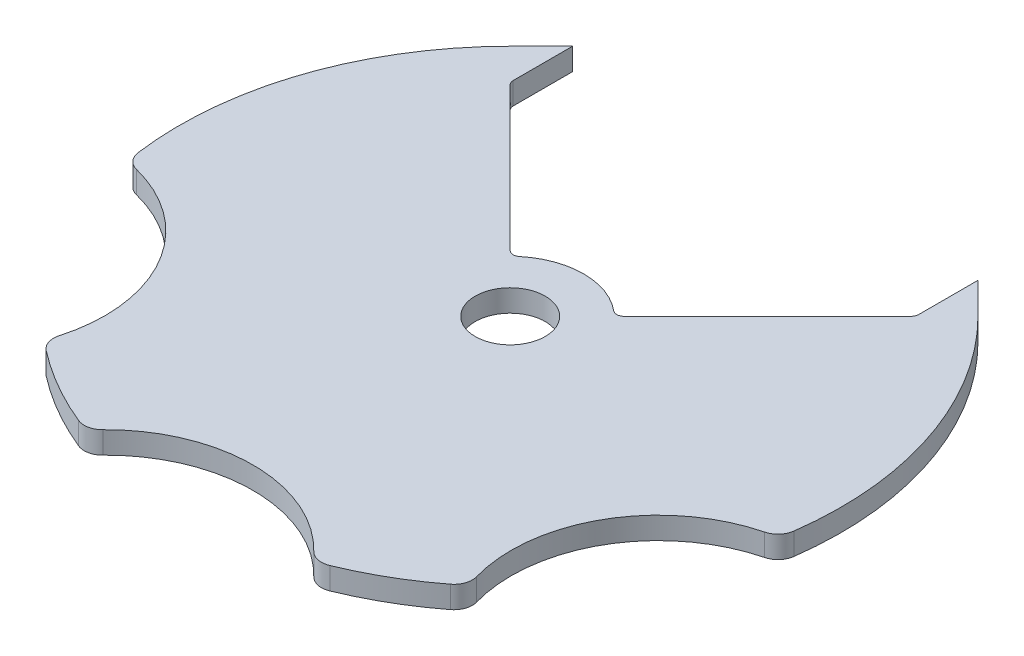
ISO-10303-21;
HEADER;
FILE_DESCRIPTION(('STEP AP214'),'2;1');
FILE_NAME('part.step','',(''),(''),'','','');
FILE_SCHEMA(('AUTOMOTIVE_DESIGN { 1 0 10303 214 1 1 1 1 }'));
ENDSEC;
DATA;
#1=APPLICATION_CONTEXT('core data for automotive mechanical design processes');
#2=APPLICATION_PROTOCOL_DEFINITION('international standard','automotive_design',2000,#1);
#3=PRODUCT_CONTEXT('',#1,'mechanical');
#4=PRODUCT('Part','Part','',(#3));
#5=PRODUCT_RELATED_PRODUCT_CATEGORY('part','',(#4));
#6=PRODUCT_DEFINITION_FORMATION('','',#4);
#7=PRODUCT_DEFINITION_CONTEXT('part definition',#1,'design');
#8=PRODUCT_DEFINITION('design','',#6,#7);
#9=PRODUCT_DEFINITION_SHAPE('','',#8);
#10=(LENGTH_UNIT() NAMED_UNIT(*) SI_UNIT(.MILLI.,.METRE.));
#11=(NAMED_UNIT(*) PLANE_ANGLE_UNIT() SI_UNIT($,.RADIAN.));
#12=(NAMED_UNIT(*) SI_UNIT($,.STERADIAN.) SOLID_ANGLE_UNIT());
#13=UNCERTAINTY_MEASURE_WITH_UNIT(LENGTH_MEASURE(1.E-05),#10,'distance_accuracy_value','');
#14=(GEOMETRIC_REPRESENTATION_CONTEXT(3) GLOBAL_UNCERTAINTY_ASSIGNED_CONTEXT((#13)) GLOBAL_UNIT_ASSIGNED_CONTEXT((#10,
#11,#12)) REPRESENTATION_CONTEXT('',''));
#15=CARTESIAN_POINT('',(0.,0.,0.));
#16=DIRECTION('',(0.,0.,1.));
#17=DIRECTION('',(1.,0.,0.));
#18=AXIS2_PLACEMENT_3D('',#15,#16,#17);
#19=CARTESIAN_POINT('',(0.,3.,0.));
#20=DIRECTION('',(0.,-1.,0.));
#21=DIRECTION('',(0.,0.,-1.));
#22=AXIS2_PLACEMENT_3D('',#19,#20,#21);
#23=CYLINDRICAL_SURFACE('',#22,45.);
#24=CARTESIAN_POINT('',(0.,0.,0.));
#25=DIRECTION('',(0.,1.,0.));
#26=DIRECTION('',(0.,0.,1.));
#27=AXIS2_PLACEMENT_3D('',#24,#25,#26);
#28=CIRCLE('',#27,45.);
#29=CARTESIAN_POINT('',(-31.8198051533945,0.,-31.8198051533948));
#30=VERTEX_POINT('',#29);
#31=CARTESIAN_POINT('',(-44.5954508550735,0.,6.02044541813344));
#32=VERTEX_POINT('',#31);
#33=EDGE_CURVE('E282',#30,#32,#28,.T.);
#34=ORIENTED_EDGE('',*,*,#33,.T.);
#35=DIRECTION('',(0.,-1.,0.));
#36=VECTOR('',#35,1.);
#37=CARTESIAN_POINT('',(-44.5954508550735,3.,6.02044541813344));
#38=LINE('',#37,#36);
#39=CARTESIAN_POINT('',(-44.5954508550735,3.,6.02044541813344));
#40=VERTEX_POINT('',#39);
#41=EDGE_CURVE('E13',#32,#40,#38,.F.);
#42=ORIENTED_EDGE('',*,*,#41,.T.);
#43=CARTESIAN_POINT('',(0.,3.,0.));
#44=DIRECTION('',(0.,1.,0.));
#45=DIRECTION('',(0.,0.,1.));
#46=AXIS2_PLACEMENT_3D('',#43,#44,#45);
#47=CIRCLE('',#46,45.);
#48=CARTESIAN_POINT('',(-31.8198051533945,3.,-31.8198051533948));
#49=VERTEX_POINT('',#48);
#50=EDGE_CURVE('E267',#49,#40,#47,.T.);
#51=ORIENTED_EDGE('',*,*,#50,.F.);
#52=DIRECTION('',(0.,-1.,0.));
#53=VECTOR('',#52,1.);
#54=CARTESIAN_POINT('',(-31.8198051533945,3.,-31.8198051533948));
#55=LINE('',#54,#53);
#56=EDGE_CURVE('E290',#49,#30,#55,.T.);
#57=ORIENTED_EDGE('',*,*,#56,.T.);
#58=EDGE_LOOP('',(#34,#42,#51,#57));
#59=FACE_BOUND('',#58,.T.);
#60=ADVANCED_FACE('F47',(#59),#23,.T.);
#61=CARTESIAN_POINT('',(17.0838667533358,0.,41.6310160427807));
#62=VERTEX_POINT('',#61);
#63=CARTESIAN_POINT('',(27.5115841017376,0.,35.6105706246477));
#64=VERTEX_POINT('',#63);
#65=EDGE_CURVE('E286',#62,#64,#28,.T.);
#66=ORIENTED_EDGE('',*,*,#65,.T.);
#67=DIRECTION('',(0.,-1.,0.));
#68=VECTOR('',#67,1.);
#69=CARTESIAN_POINT('',(27.5115841017376,3.,35.6105706246477));
#70=LINE('',#69,#68);
#71=CARTESIAN_POINT('',(27.5115841017376,3.,35.6105706246477));
#72=VERTEX_POINT('',#71);
#73=EDGE_CURVE('E359',#64,#72,#70,.F.);
#74=ORIENTED_EDGE('',*,*,#73,.T.);
#75=CARTESIAN_POINT('',(17.0838667533358,3.,41.6310160427807));
#76=VERTEX_POINT('',#75);
#77=EDGE_CURVE('E272',#76,#72,#47,.T.);
#78=ORIENTED_EDGE('',*,*,#77,.F.);
#79=DIRECTION('',(0.,-1.,0.));
#80=VECTOR('',#79,1.);
#81=CARTESIAN_POINT('',(17.0838667533358,3.,41.6310160427807));
#82=LINE('',#81,#80);
#83=EDGE_CURVE('E356',#76,#62,#82,.T.);
#84=ORIENTED_EDGE('',*,*,#83,.T.);
#85=EDGE_LOOP('',(#66,#74,#78,#84));
#86=FACE_BOUND('',#85,.T.);
#87=ADVANCED_FACE('F424',(#86),#23,.T.);
#88=CARTESIAN_POINT('',(-27.5115841017376,0.,35.6105706246477));
#89=VERTEX_POINT('',#88);
#90=CARTESIAN_POINT('',(-17.0838667533358,0.,41.6310160427807));
#91=VERTEX_POINT('',#90);
#92=EDGE_CURVE('E285',#89,#91,#28,.T.);
#93=ORIENTED_EDGE('',*,*,#92,.T.);
#94=DIRECTION('',(0.,-1.,0.));
#95=VECTOR('',#94,1.);
#96=CARTESIAN_POINT('',(-17.0838667533358,3.,41.6310160427807));
#97=LINE('',#96,#95);
#98=CARTESIAN_POINT('',(-17.0838667533358,3.,41.6310160427807));
#99=VERTEX_POINT('',#98);
#100=EDGE_CURVE('E368',#91,#99,#97,.F.);
#101=ORIENTED_EDGE('',*,*,#100,.T.);
#102=CARTESIAN_POINT('',(-27.5115841017376,3.,35.6105706246477));
#103=VERTEX_POINT('',#102);
#104=EDGE_CURVE('E271',#103,#99,#47,.T.);
#105=ORIENTED_EDGE('',*,*,#104,.F.);
#106=DIRECTION('',(0.,-1.,0.));
#107=VECTOR('',#106,1.);
#108=CARTESIAN_POINT('',(-27.5115841017376,3.,35.6105706246477));
#109=LINE('',#108,#107);
#110=EDGE_CURVE('E365',#103,#89,#109,.T.);
#111=ORIENTED_EDGE('',*,*,#110,.T.);
#112=EDGE_LOOP('',(#93,#101,#105,#111));
#113=FACE_BOUND('',#112,.T.);
#114=ADVANCED_FACE('F392',(#113),#23,.T.);
#115=CARTESIAN_POINT('',(0.,3.,0.));
#116=DIRECTION('',(0.,1.,0.));
#117=DIRECTION('',(0.,0.,1.));
#118=AXIS2_PLACEMENT_3D('',#115,#116,#117);
#119=PLANE('',#118);
#120=CARTESIAN_POINT('',(47.631397208144,3.,27.5000000000002));
#121=DIRECTION('',(0.,1.,0.));
#122=DIRECTION('',(0.,0.,1.));
#123=AXIS2_PLACEMENT_3D('',#120,#121,#122);
#124=CIRCLE('',#123,20.);
#125=CARTESIAN_POINT('',(42.7305337409666,3.,8.1097566473219));
#126=VERTEX_POINT('',#125);
#127=CARTESIAN_POINT('',(28.3885221455735,3.,32.9508494132845));
#128=VERTEX_POINT('',#127);
#129=EDGE_CURVE('E385',#126,#128,#124,.T.);
#130=ORIENTED_EDGE('',*,*,#129,.F.);
#131=CARTESIAN_POINT('',(42.1179258075694,3.,5.6859762282371));
#132=DIRECTION('',(0.,1.,0.));
#133=DIRECTION('',(0.,0.,1.));
#134=AXIS2_PLACEMENT_3D('',#131,#132,#133);
#135=CIRCLE('',#134,2.5);
#136=CARTESIAN_POINT('',(44.5954508550735,3.,6.0204454181334));
#137=VERTEX_POINT('',#136);
#138=EDGE_CURVE('E354',#126,#137,#135,.T.);
#139=ORIENTED_EDGE('',*,*,#138,.T.);
#140=CARTESIAN_POINT('',(31.8198051533948,3.,-31.8198051533945));
#141=VERTEX_POINT('',#140);
#142=EDGE_CURVE('E234',#137,#141,#47,.T.);
#143=ORIENTED_EDGE('',*,*,#142,.T.);
#144=DIRECTION('',(-0.707106781186547,0.,-0.707106781186547));
#145=VECTOR('',#144,1.);
#146=CARTESIAN_POINT('',(31.8198051533945,3.,-31.8198051533948));
#147=LINE('',#146,#145);
#148=CARTESIAN_POINT('',(27.5771644662753,3.,-36.0624458405139));
#149=VERTEX_POINT('',#148);
#150=EDGE_CURVE('E215',#141,#149,#147,.T.);
#151=ORIENTED_EDGE('',*,*,#150,.T.);
#152=DIRECTION('',(0.,0.,1.));
#153=VECTOR('',#152,1.);
#154=CARTESIAN_POINT('',(27.5771644662753,3.,-36.0624458405139));
#155=LINE('',#154,#153);
#156=CARTESIAN_POINT('',(27.5771644662753,3.,-27.9913780286481));
#157=VERTEX_POINT('',#156);
#158=EDGE_CURVE('E223',#149,#157,#155,.T.);
#159=ORIENTED_EDGE('',*,*,#158,.T.);
#160=CARTESIAN_POINT('',(26.5771644662753,3.,-27.9913780286481));
#161=DIRECTION('',(0.,1.,0.));
#162=DIRECTION('',(0.,0.,1.));
#163=AXIS2_PLACEMENT_3D('',#160,#161,#162);
#164=CIRCLE('',#163,1.);
#165=CARTESIAN_POINT('',(27.2842712474619,3.,-27.2842712474616));
#166=VERTEX_POINT('',#165);
#167=EDGE_CURVE('E311',#157,#166,#164,.F.);
#168=ORIENTED_EDGE('',*,*,#167,.T.);
#169=DIRECTION('',(-0.707106781186551,0.,0.707106781186544));
#170=VECTOR('',#169,1.);
#171=CARTESIAN_POINT('',(7.07106781186551,3.,-7.07106781186544));
#172=LINE('',#171,#170);
#173=CARTESIAN_POINT('',(7.74596669241487,3.,-7.7459666924148));
#174=VERTEX_POINT('',#173);
#175=EDGE_CURVE('E270',#166,#174,#172,.T.);
#176=ORIENTED_EDGE('',*,*,#175,.T.);
#177=CARTESIAN_POINT('',(7.03885991122833,3.,-8.45307347360135));
#178=DIRECTION('',(0.,1.,0.));
#179=DIRECTION('',(0.,0.,1.));
#180=AXIS2_PLACEMENT_3D('',#177,#178,#179);
#181=CIRCLE('',#180,1.);
#182=CARTESIAN_POINT('',(6.39896355566212,3.,-7.6846122487285));
#183=VERTEX_POINT('',#182);
#184=EDGE_CURVE('E321',#174,#183,#181,.F.);
#185=ORIENTED_EDGE('',*,*,#184,.T.);
#186=CARTESIAN_POINT('',(0.,3.,0.));
#187=DIRECTION('',(0.,1.,0.));
#188=DIRECTION('',(0.,0.,1.));
#189=AXIS2_PLACEMENT_3D('',#186,#187,#188);
#190=CIRCLE('',#189,10.);
#191=CARTESIAN_POINT('',(-6.39896355566204,3.,-7.68461224872856));
#192=VERTEX_POINT('',#191);
#193=EDGE_CURVE('E260',#183,#192,#190,.T.);
#194=ORIENTED_EDGE('',*,*,#193,.T.);
#195=CARTESIAN_POINT('',(-7.03885991122825,3.,-8.45307347360142));
#196=DIRECTION('',(0.,1.,0.));
#197=DIRECTION('',(0.,0.,1.));
#198=AXIS2_PLACEMENT_3D('',#195,#196,#197);
#199=CIRCLE('',#198,1.);
#200=CARTESIAN_POINT('',(-7.74596669241481,3.,-7.74596669241488));
#201=VERTEX_POINT('',#200);
#202=EDGE_CURVE('E325',#192,#201,#199,.F.);
#203=ORIENTED_EDGE('',*,*,#202,.T.);
#204=DIRECTION('',(-0.707106781186544,0.,-0.707106781186551));
#205=VECTOR('',#204,1.);
#206=CARTESIAN_POINT('',(-31.8198051533945,3.,-31.8198051533948));
#207=LINE('',#206,#205);
#208=CARTESIAN_POINT('',(-27.2842712474619,3.,-27.2842712474622));
#209=VERTEX_POINT('',#208);
#210=EDGE_CURVE('E263',#201,#209,#207,.T.);
#211=ORIENTED_EDGE('',*,*,#210,.T.);
#212=CARTESIAN_POINT('',(-26.5771644662753,3.,-27.9913780286487));
#213=DIRECTION('',(0.,1.,0.));
#214=DIRECTION('',(0.,0.,1.));
#215=AXIS2_PLACEMENT_3D('',#212,#213,#214);
#216=CIRCLE('',#215,1.);
#217=CARTESIAN_POINT('',(-27.5771644662753,3.,-27.9913780286487));
#218=VERTEX_POINT('',#217);
#219=EDGE_CURVE('E315',#209,#218,#216,.F.);
#220=ORIENTED_EDGE('',*,*,#219,.T.);
#221=DIRECTION('',(0.,0.,-1.));
#222=VECTOR('',#221,1.);
#223=CARTESIAN_POINT('',(-27.5771644662753,3.,-36.0624458405139));
#224=LINE('',#223,#222);
#225=CARTESIAN_POINT('',(-27.5771644662753,3.,-36.0624458405139));
#226=VERTEX_POINT('',#225);
#227=EDGE_CURVE('E243',#218,#226,#224,.T.);
#228=ORIENTED_EDGE('',*,*,#227,.T.);
#229=DIRECTION('',(-0.707106781186547,0.,0.707106781186547));
#230=VECTOR('',#229,1.);
#231=CARTESIAN_POINT('',(-31.8198051533945,3.,-31.8198051533948));
#232=LINE('',#231,#230);
#233=EDGE_CURVE('E245',#226,#49,#232,.T.);
#234=ORIENTED_EDGE('',*,*,#233,.T.);
#235=ORIENTED_EDGE('',*,*,#50,.T.);
#236=CARTESIAN_POINT('',(-42.1179258075694,3.,5.68597622823714));
#237=DIRECTION('',(0.,1.,0.));
#238=DIRECTION('',(0.,0.,1.));
#239=AXIS2_PLACEMENT_3D('',#236,#237,#238);
#240=CIRCLE('',#239,2.5);
#241=CARTESIAN_POINT('',(-42.7305337409666,3.,8.10975664732193));
#242=VERTEX_POINT('',#241);
#243=EDGE_CURVE('E62',#40,#242,#240,.T.);
#244=ORIENTED_EDGE('',*,*,#243,.T.);
#245=CARTESIAN_POINT('',(-47.631397208144,3.,27.5000000000002));
#246=DIRECTION('',(0.,1.,0.));
#247=DIRECTION('',(0.,0.,1.));
#248=AXIS2_PLACEMENT_3D('',#245,#246,#247);
#249=CIRCLE('',#248,20.);
#250=CARTESIAN_POINT('',(-28.3885221455735,3.,32.9508494132845));
#251=VERTEX_POINT('',#250);
#252=EDGE_CURVE('E378',#251,#242,#249,.T.);
#253=ORIENTED_EDGE('',*,*,#252,.F.);
#254=CARTESIAN_POINT('',(-25.9831627627522,3.,33.632205589945));
#255=DIRECTION('',(0.,1.,0.));
#256=DIRECTION('',(0.,0.,1.));
#257=AXIS2_PLACEMENT_3D('',#254,#255,#256);
#258=CIRCLE('',#257,2.5);
#259=EDGE_CURVE('E347',#251,#103,#258,.T.);
#260=ORIENTED_EDGE('',*,*,#259,.T.);
#261=ORIENTED_EDGE('',*,*,#104,.T.);
#262=CARTESIAN_POINT('',(-16.1347630448172,3.,39.3181818181818));
#263=DIRECTION('',(0.,1.,0.));
#264=DIRECTION('',(0.,0.,1.));
#265=AXIS2_PLACEMENT_3D('',#262,#263,#264);
#266=CIRCLE('',#265,2.5);
#267=CARTESIAN_POINT('',(-14.342011595393,3.,41.0606060606061));
#268=VERTEX_POINT('',#267);
#269=EDGE_CURVE('E349',#99,#268,#266,.T.);
#270=ORIENTED_EDGE('',*,*,#269,.T.);
#271=CARTESIAN_POINT('',(0.,3.,55.));
#272=DIRECTION('',(0.,1.,0.));
#273=DIRECTION('',(0.,0.,1.));
#274=AXIS2_PLACEMENT_3D('',#271,#272,#273);
#275=CIRCLE('',#274,20.);
#276=CARTESIAN_POINT('',(14.342011595393,3.,41.0606060606061));
#277=VERTEX_POINT('',#276);
#278=EDGE_CURVE('E411',#277,#268,#275,.T.);
#279=ORIENTED_EDGE('',*,*,#278,.F.);
#280=CARTESIAN_POINT('',(16.1347630448172,3.,39.3181818181818));
#281=DIRECTION('',(0.,1.,0.));
#282=DIRECTION('',(0.,0.,1.));
#283=AXIS2_PLACEMENT_3D('',#280,#281,#282);
#284=CIRCLE('',#283,2.5);
#285=EDGE_CURVE('E351',#277,#76,#284,.T.);
#286=ORIENTED_EDGE('',*,*,#285,.T.);
#287=ORIENTED_EDGE('',*,*,#77,.T.);
#288=CARTESIAN_POINT('',(25.9831627627521,3.,33.6322055899451));
#289=DIRECTION('',(0.,1.,0.));
#290=DIRECTION('',(0.,0.,1.));
#291=AXIS2_PLACEMENT_3D('',#288,#289,#290);
#292=CIRCLE('',#291,2.5);
#293=EDGE_CURVE('E69',#72,#128,#292,.T.);
#294=ORIENTED_EDGE('',*,*,#293,.T.);
#295=EDGE_LOOP('',(#130,#139,#143,#151,#159,#168,#176,#185,#194,#203,#211,#220,#228,#234,#235,
#244,#253,#260,#261,#270,#279,#286,#287,#294));
#296=FACE_BOUND('',#295,.T.);
#297=CARTESIAN_POINT('',(0.,3.,0.));
#298=DIRECTION('',(0.,1.,0.));
#299=DIRECTION('',(0.,0.,1.));
#300=AXIS2_PLACEMENT_3D('',#297,#298,#299);
#301=CIRCLE('',#300,4.7625);
#302=CARTESIAN_POINT('',(0.,3.,4.7625));
#303=VERTEX_POINT('',#302);
#304=EDGE_CURVE('E254',#303,#303,#301,.T.);
#305=ORIENTED_EDGE('',*,*,#304,.F.);
#306=EDGE_LOOP('',(#305));
#307=FACE_BOUND('',#306,.T.);
#308=ADVANCED_FACE('F231',(#296,#307),#119,.T.);
#309=CARTESIAN_POINT('',(0.,0.,0.));
#310=DIRECTION('',(0.,1.,0.));
#311=DIRECTION('',(0.,0.,1.));
#312=AXIS2_PLACEMENT_3D('',#309,#310,#311);
#313=PLANE('',#312);
#314=CARTESIAN_POINT('',(44.5954508550735,0.,6.0204454181334));
#315=VERTEX_POINT('',#314);
#316=CARTESIAN_POINT('',(31.8198051533948,0.,-31.8198051533945));
#317=VERTEX_POINT('',#316);
#318=EDGE_CURVE('E281',#315,#317,#28,.T.);
#319=ORIENTED_EDGE('',*,*,#318,.F.);
#320=CARTESIAN_POINT('',(42.1179258075694,0.,5.6859762282371));
#321=DIRECTION('',(0.,1.,0.));
#322=DIRECTION('',(0.,0.,1.));
#323=AXIS2_PLACEMENT_3D('',#320,#321,#322);
#324=CIRCLE('',#323,2.5);
#325=CARTESIAN_POINT('',(42.7305337409666,0.,8.1097566473219));
#326=VERTEX_POINT('',#325);
#327=EDGE_CURVE('E340',#315,#326,#324,.F.);
#328=ORIENTED_EDGE('',*,*,#327,.T.);
#329=CARTESIAN_POINT('',(47.631397208144,0.,27.5000000000002));
#330=DIRECTION('',(0.,1.,0.));
#331=DIRECTION('',(0.,0.,1.));
#332=AXIS2_PLACEMENT_3D('',#329,#330,#331);
#333=CIRCLE('',#332,20.);
#334=CARTESIAN_POINT('',(28.3885221455735,0.,32.9508494132845));
#335=VERTEX_POINT('',#334);
#336=EDGE_CURVE('E407',#326,#335,#333,.T.);
#337=ORIENTED_EDGE('',*,*,#336,.T.);
#338=CARTESIAN_POINT('',(25.9831627627521,0.,33.6322055899451));
#339=DIRECTION('',(0.,1.,0.));
#340=DIRECTION('',(0.,0.,1.));
#341=AXIS2_PLACEMENT_3D('',#338,#339,#340);
#342=CIRCLE('',#341,2.5);
#343=EDGE_CURVE('E338',#335,#64,#342,.F.);
#344=ORIENTED_EDGE('',*,*,#343,.T.);
#345=ORIENTED_EDGE('',*,*,#65,.F.);
#346=CARTESIAN_POINT('',(16.1347630448172,0.,39.3181818181818));
#347=DIRECTION('',(0.,1.,0.));
#348=DIRECTION('',(0.,0.,1.));
#349=AXIS2_PLACEMENT_3D('',#346,#347,#348);
#350=CIRCLE('',#349,2.5);
#351=CARTESIAN_POINT('',(14.342011595393,0.,41.0606060606061));
#352=VERTEX_POINT('',#351);
#353=EDGE_CURVE('E336',#62,#352,#350,.F.);
#354=ORIENTED_EDGE('',*,*,#353,.T.);
#355=CARTESIAN_POINT('',(0.,0.,55.));
#356=DIRECTION('',(0.,1.,0.));
#357=DIRECTION('',(0.,0.,1.));
#358=AXIS2_PLACEMENT_3D('',#355,#356,#357);
#359=CIRCLE('',#358,20.);
#360=CARTESIAN_POINT('',(-14.342011595393,0.,41.0606060606061));
#361=VERTEX_POINT('',#360);
#362=EDGE_CURVE('E384',#352,#361,#359,.T.);
#363=ORIENTED_EDGE('',*,*,#362,.T.);
#364=CARTESIAN_POINT('',(-16.1347630448172,0.,39.3181818181818));
#365=DIRECTION('',(0.,1.,0.));
#366=DIRECTION('',(0.,0.,1.));
#367=AXIS2_PLACEMENT_3D('',#364,#365,#366);
#368=CIRCLE('',#367,2.5);
#369=EDGE_CURVE('E334',#361,#91,#368,.F.);
#370=ORIENTED_EDGE('',*,*,#369,.T.);
#371=ORIENTED_EDGE('',*,*,#92,.F.);
#372=CARTESIAN_POINT('',(-25.9831627627522,0.,33.632205589945));
#373=DIRECTION('',(0.,1.,0.));
#374=DIRECTION('',(0.,0.,1.));
#375=AXIS2_PLACEMENT_3D('',#372,#373,#374);
#376=CIRCLE('',#375,2.5);
#377=CARTESIAN_POINT('',(-28.3885221455735,0.,32.9508494132845));
#378=VERTEX_POINT('',#377);
#379=EDGE_CURVE('E332',#89,#378,#376,.F.);
#380=ORIENTED_EDGE('',*,*,#379,.T.);
#381=CARTESIAN_POINT('',(-47.631397208144,0.,27.5000000000002));
#382=DIRECTION('',(0.,1.,0.));
#383=DIRECTION('',(0.,0.,1.));
#384=AXIS2_PLACEMENT_3D('',#381,#382,#383);
#385=CIRCLE('',#384,20.);
#386=CARTESIAN_POINT('',(-42.7305337409666,0.,8.10975664732193));
#387=VERTEX_POINT('',#386);
#388=EDGE_CURVE('E228',#378,#387,#385,.T.);
#389=ORIENTED_EDGE('',*,*,#388,.T.);
#390=CARTESIAN_POINT('',(-42.1179258075694,0.,5.68597622823714));
#391=DIRECTION('',(0.,1.,0.));
#392=DIRECTION('',(0.,0.,1.));
#393=AXIS2_PLACEMENT_3D('',#390,#391,#392);
#394=CIRCLE('',#393,2.5);
#395=EDGE_CURVE('E330',#387,#32,#394,.F.);
#396=ORIENTED_EDGE('',*,*,#395,.T.);
#397=ORIENTED_EDGE('',*,*,#33,.F.);
#398=DIRECTION('',(0.707106781186548,0.,-0.707106781186548));
#399=VECTOR('',#398,1.);
#400=CARTESIAN_POINT('',(-31.8198051533945,0.,-31.8198051533948));
#401=LINE('',#400,#399);
#402=CARTESIAN_POINT('',(-27.5771644662753,0.,-36.0624458405139));
#403=VERTEX_POINT('',#402);
#404=EDGE_CURVE('E239',#30,#403,#401,.T.);
#405=ORIENTED_EDGE('',*,*,#404,.T.);
#406=DIRECTION('',(0.,0.,1.));
#407=VECTOR('',#406,1.);
#408=CARTESIAN_POINT('',(-27.5771644662753,0.,-36.0624458405139));
#409=LINE('',#408,#407);
#410=CARTESIAN_POINT('',(-27.5771644662753,0.,-27.9913780286487));
#411=VERTEX_POINT('',#410);
#412=EDGE_CURVE('E241',#403,#411,#409,.T.);
#413=ORIENTED_EDGE('',*,*,#412,.T.);
#414=CARTESIAN_POINT('',(-26.5771644662753,0.,-27.9913780286487));
#415=DIRECTION('',(0.,1.,0.));
#416=DIRECTION('',(0.,0.,1.));
#417=AXIS2_PLACEMENT_3D('',#414,#415,#416);
#418=CIRCLE('',#417,1.);
#419=CARTESIAN_POINT('',(-27.2842712474619,0.,-27.2842712474622));
#420=VERTEX_POINT('',#419);
#421=EDGE_CURVE('E317',#411,#420,#418,.T.);
#422=ORIENTED_EDGE('',*,*,#421,.T.);
#423=DIRECTION('',(-0.707106781186544,0.,-0.707106781186551));
#424=VECTOR('',#423,1.);
#425=CARTESIAN_POINT('',(-31.8198051533945,0.,-31.8198051533948));
#426=LINE('',#425,#424);
#427=CARTESIAN_POINT('',(-7.74596669241481,0.,-7.74596669241488));
#428=VERTEX_POINT('',#427);
#429=EDGE_CURVE('E278',#428,#420,#426,.T.);
#430=ORIENTED_EDGE('',*,*,#429,.F.);
#431=CARTESIAN_POINT('',(-7.03885991122825,0.,-8.45307347360142));
#432=DIRECTION('',(0.,1.,0.));
#433=DIRECTION('',(0.,0.,1.));
#434=AXIS2_PLACEMENT_3D('',#431,#432,#433);
#435=CIRCLE('',#434,1.);
#436=CARTESIAN_POINT('',(-6.39896355566204,0.,-7.68461224872856));
#437=VERTEX_POINT('',#436);
#438=EDGE_CURVE('E323',#428,#437,#435,.T.);
#439=ORIENTED_EDGE('',*,*,#438,.T.);
#440=CARTESIAN_POINT('',(0.,0.,0.));
#441=DIRECTION('',(0.,1.,0.));
#442=DIRECTION('',(0.,0.,1.));
#443=AXIS2_PLACEMENT_3D('',#440,#441,#442);
#444=CIRCLE('',#443,10.);
#445=CARTESIAN_POINT('',(6.39896355566212,0.,-7.6846122487285));
#446=VERTEX_POINT('',#445);
#447=EDGE_CURVE('E257',#446,#437,#444,.T.);
#448=ORIENTED_EDGE('',*,*,#447,.F.);
#449=CARTESIAN_POINT('',(7.03885991122833,0.,-8.45307347360135));
#450=DIRECTION('',(0.,1.,0.));
#451=DIRECTION('',(0.,0.,1.));
#452=AXIS2_PLACEMENT_3D('',#449,#450,#451);
#453=CIRCLE('',#452,1.);
#454=CARTESIAN_POINT('',(7.74596669241487,0.,-7.7459666924148));
#455=VERTEX_POINT('',#454);
#456=EDGE_CURVE('E319',#446,#455,#453,.T.);
#457=ORIENTED_EDGE('',*,*,#456,.T.);
#458=DIRECTION('',(-0.707106781186551,0.,0.707106781186544));
#459=VECTOR('',#458,1.);
#460=CARTESIAN_POINT('',(7.07106781186551,0.,-7.07106781186544));
#461=LINE('',#460,#459);
#462=CARTESIAN_POINT('',(27.2842712474619,0.,-27.2842712474616));
#463=VERTEX_POINT('',#462);
#464=EDGE_CURVE('E264',#463,#455,#461,.T.);
#465=ORIENTED_EDGE('',*,*,#464,.F.);
#466=CARTESIAN_POINT('',(26.5771644662753,0.,-27.9913780286481));
#467=DIRECTION('',(0.,1.,0.));
#468=DIRECTION('',(0.,0.,1.));
#469=AXIS2_PLACEMENT_3D('',#466,#467,#468);
#470=CIRCLE('',#469,1.);
#471=CARTESIAN_POINT('',(27.5771644662753,0.,-27.9913780286481));
#472=VERTEX_POINT('',#471);
#473=EDGE_CURVE('E313',#463,#472,#470,.T.);
#474=ORIENTED_EDGE('',*,*,#473,.T.);
#475=DIRECTION('',(0.,0.,-1.));
#476=VECTOR('',#475,1.);
#477=CARTESIAN_POINT('',(27.5771644662753,0.,-36.0624458405139));
#478=LINE('',#477,#476);
#479=CARTESIAN_POINT('',(27.5771644662753,0.,-36.0624458405139));
#480=VERTEX_POINT('',#479);
#481=EDGE_CURVE('E246',#472,#480,#478,.T.);
#482=ORIENTED_EDGE('',*,*,#481,.T.);
#483=DIRECTION('',(0.707106781186548,0.,0.707106781186548));
#484=VECTOR('',#483,1.);
#485=CARTESIAN_POINT('',(31.8198051533945,0.,-31.8198051533948));
#486=LINE('',#485,#484);
#487=EDGE_CURVE('E217',#480,#317,#486,.T.);
#488=ORIENTED_EDGE('',*,*,#487,.T.);
#489=EDGE_LOOP('',(#319,#328,#337,#344,#345,#354,#363,#370,#371,#380,#389,#396,#397,#405,#413,
#422,#430,#439,#448,#457,#465,#474,#482,#488));
#490=FACE_BOUND('',#489,.T.);
#491=CARTESIAN_POINT('',(0.,0.,0.));
#492=DIRECTION('',(0.,1.,0.));
#493=DIRECTION('',(0.,0.,1.));
#494=AXIS2_PLACEMENT_3D('',#491,#492,#493);
#495=CIRCLE('',#494,4.7625);
#496=CARTESIAN_POINT('',(0.,0.,4.7625));
#497=VERTEX_POINT('',#496);
#498=EDGE_CURVE('E253',#497,#497,#495,.T.);
#499=ORIENTED_EDGE('',*,*,#498,.T.);
#500=EDGE_LOOP('',(#499));
#501=FACE_BOUND('',#500,.T.);
#502=ADVANCED_FACE('F396',(#490,#501),#313,.F.);
#503=CARTESIAN_POINT('',(0.,3.,0.));
#504=DIRECTION('',(0.,-1.,0.));
#505=DIRECTION('',(0.,0.,-1.));
#506=AXIS2_PLACEMENT_3D('',#503,#504,#505);
#507=CYLINDRICAL_SURFACE('',#506,10.);
#508=ORIENTED_EDGE('',*,*,#193,.F.);
#509=DIRECTION('',(0.,-1.,0.));
#510=VECTOR('',#509,1.);
#511=CARTESIAN_POINT('',(6.39896355566212,3.,-7.6846122487285));
#512=LINE('',#511,#510);
#513=EDGE_CURVE('E308',#183,#446,#512,.T.);
#514=ORIENTED_EDGE('',*,*,#513,.T.);
#515=ORIENTED_EDGE('',*,*,#447,.T.);
#516=DIRECTION('',(0.,-1.,0.));
#517=VECTOR('',#516,1.);
#518=CARTESIAN_POINT('',(-6.39896355566204,3.,-7.68461224872856));
#519=LINE('',#518,#517);
#520=EDGE_CURVE('E306',#437,#192,#519,.F.);
#521=ORIENTED_EDGE('',*,*,#520,.T.);
#522=EDGE_LOOP('',(#508,#514,#515,#521));
#523=FACE_BOUND('',#522,.T.);
#524=ADVANCED_FACE('F463',(#523),#507,.T.);
#525=CARTESIAN_POINT('',(-31.8198051533945,3.,-31.8198051533948));
#526=DIRECTION('',(-0.707106781186551,0.,0.707106781186544));
#527=DIRECTION('',(0.707106781186544,0.,0.707106781186551));
#528=AXIS2_PLACEMENT_3D('',#525,#526,#527);
#529=PLANE('',#528);
#530=ORIENTED_EDGE('',*,*,#429,.T.);
#531=DIRECTION('',(0.,1.,0.));
#532=VECTOR('',#531,1.);
#533=CARTESIAN_POINT('',(-27.2842712474619,3.,-27.2842712474622));
#534=LINE('',#533,#532);
#535=EDGE_CURVE('E301',#420,#209,#534,.T.);
#536=ORIENTED_EDGE('',*,*,#535,.T.);
#537=ORIENTED_EDGE('',*,*,#210,.F.);
#538=DIRECTION('',(0.,1.,0.));
#539=VECTOR('',#538,1.);
#540=CARTESIAN_POINT('',(-7.7459666924148,0.,-7.74596669241487));
#541=LINE('',#540,#539);
#542=EDGE_CURVE('E298',#201,#428,#541,.F.);
#543=ORIENTED_EDGE('',*,*,#542,.T.);
#544=EDGE_LOOP('',(#530,#536,#537,#543));
#545=FACE_BOUND('',#544,.T.);
#546=ADVANCED_FACE('F456',(#545),#529,.F.);
#547=ORIENTED_EDGE('',*,*,#142,.F.);
#548=DIRECTION('',(0.,-1.,0.));
#549=VECTOR('',#548,1.);
#550=CARTESIAN_POINT('',(44.5954508550735,3.,6.0204454181334));
#551=LINE('',#550,#549);
#552=EDGE_CURVE('E327',#137,#315,#551,.T.);
#553=ORIENTED_EDGE('',*,*,#552,.T.);
#554=ORIENTED_EDGE('',*,*,#318,.T.);
#555=DIRECTION('',(0.,-1.,0.));
#556=VECTOR('',#555,1.);
#557=CARTESIAN_POINT('',(31.8198051533948,3.,-31.8198051533945));
#558=LINE('',#557,#556);
#559=EDGE_CURVE('E275',#141,#317,#558,.T.);
#560=ORIENTED_EDGE('',*,*,#559,.F.);
#561=EDGE_LOOP('',(#547,#553,#554,#560));
#562=FACE_BOUND('',#561,.T.);
#563=ADVANCED_FACE('F402',(#562),#23,.T.);
#564=CARTESIAN_POINT('',(7.07106781186551,3.,-7.07106781186544));
#565=DIRECTION('',(0.707106781186544,0.,0.707106781186551));
#566=DIRECTION('',(0.707106781186551,0.,-0.707106781186544));
#567=AXIS2_PLACEMENT_3D('',#564,#565,#566);
#568=PLANE('',#567);
#569=ORIENTED_EDGE('',*,*,#175,.F.);
#570=DIRECTION('',(0.,1.,0.));
#571=VECTOR('',#570,1.);
#572=CARTESIAN_POINT('',(27.2842712474619,3.,-27.2842712474616));
#573=LINE('',#572,#571);
#574=EDGE_CURVE('E296',#166,#463,#573,.F.);
#575=ORIENTED_EDGE('',*,*,#574,.T.);
#576=ORIENTED_EDGE('',*,*,#464,.T.);
#577=DIRECTION('',(0.,1.,0.));
#578=VECTOR('',#577,1.);
#579=CARTESIAN_POINT('',(7.74596669241487,3.,-7.7459666924148));
#580=LINE('',#579,#578);
#581=EDGE_CURVE('E294',#455,#174,#580,.T.);
#582=ORIENTED_EDGE('',*,*,#581,.T.);
#583=EDGE_LOOP('',(#569,#575,#576,#582));
#584=FACE_BOUND('',#583,.T.);
#585=ADVANCED_FACE('F455',(#584),#568,.F.);
#586=CARTESIAN_POINT('',(0.,3.,0.));
#587=DIRECTION('',(0.,-1.,0.));
#588=DIRECTION('',(0.,0.,-1.));
#589=AXIS2_PLACEMENT_3D('',#586,#587,#588);
#590=CYLINDRICAL_SURFACE('',#589,4.7625);
#591=ORIENTED_EDGE('',*,*,#304,.T.);
#592=EDGE_LOOP('',(#591));
#593=FACE_BOUND('',#592,.T.);
#594=ORIENTED_EDGE('',*,*,#498,.F.);
#595=EDGE_LOOP('',(#594));
#596=FACE_BOUND('',#595,.T.);
#597=ADVANCED_FACE('F461',(#593,#596),#590,.F.);
#598=CARTESIAN_POINT('',(-31.8198051533945,-9.48683298050508,-31.8198051533948));
#599=DIRECTION('',(-0.707106781186548,0.,-0.707106781186548));
#600=DIRECTION('',(-0.707106781186548,0.,0.707106781186548));
#601=AXIS2_PLACEMENT_3D('',#598,#599,#600);
#602=PLANE('',#601);
#603=ORIENTED_EDGE('',*,*,#404,.F.);
#604=ORIENTED_EDGE('',*,*,#56,.F.);
#605=ORIENTED_EDGE('',*,*,#233,.F.);
#606=DIRECTION('',(0.,1.,0.));
#607=VECTOR('',#606,1.);
#608=CARTESIAN_POINT('',(-27.5771644662753,-9.48683298050508,-36.0624458405139));
#609=LINE('',#608,#607);
#610=EDGE_CURVE('E242',#403,#226,#609,.T.);
#611=ORIENTED_EDGE('',*,*,#610,.F.);
#612=EDGE_LOOP('',(#603,#604,#605,#611));
#613=FACE_BOUND('',#612,.T.);
#614=ADVANCED_FACE('F477',(#613),#602,.T.);
#615=CARTESIAN_POINT('',(-27.5771644662753,-9.48683298050508,-36.0624458405139));
#616=DIRECTION('',(1.,0.,0.));
#617=DIRECTION('',(0.,0.,-1.));
#618=AXIS2_PLACEMENT_3D('',#615,#616,#617);
#619=PLANE('',#618);
#620=ORIENTED_EDGE('',*,*,#227,.F.);
#621=DIRECTION('',(0.,1.,0.));
#622=VECTOR('',#621,1.);
#623=CARTESIAN_POINT('',(-27.5771644662753,-9.48683298050508,-27.9913780286487));
#624=LINE('',#623,#622);
#625=EDGE_CURVE('E304',#218,#411,#624,.F.);
#626=ORIENTED_EDGE('',*,*,#625,.T.);
#627=ORIENTED_EDGE('',*,*,#412,.F.);
#628=ORIENTED_EDGE('',*,*,#610,.T.);
#629=EDGE_LOOP('',(#620,#626,#627,#628));
#630=FACE_BOUND('',#629,.T.);
#631=ADVANCED_FACE('F479',(#630),#619,.T.);
#632=CARTESIAN_POINT('',(27.5771644662753,-9.48683298050508,-36.0624458405139));
#633=DIRECTION('',(-1.,0.,0.));
#634=DIRECTION('',(0.,0.,1.));
#635=AXIS2_PLACEMENT_3D('',#632,#633,#634);
#636=PLANE('',#635);
#637=ORIENTED_EDGE('',*,*,#481,.F.);
#638=DIRECTION('',(0.,1.,0.));
#639=VECTOR('',#638,1.);
#640=CARTESIAN_POINT('',(27.5771644662753,-9.48683298050508,-27.9913780286481));
#641=LINE('',#640,#639);
#642=EDGE_CURVE('E226',#472,#157,#641,.T.);
#643=ORIENTED_EDGE('',*,*,#642,.T.);
#644=ORIENTED_EDGE('',*,*,#158,.F.);
#645=DIRECTION('',(0.,1.,0.));
#646=VECTOR('',#645,1.);
#647=CARTESIAN_POINT('',(27.5771644662753,-9.48683298050508,-36.0624458405139));
#648=LINE('',#647,#646);
#649=EDGE_CURVE('E210',#480,#149,#648,.T.);
#650=ORIENTED_EDGE('',*,*,#649,.F.);
#651=EDGE_LOOP('',(#637,#643,#644,#650));
#652=FACE_BOUND('',#651,.T.);
#653=ADVANCED_FACE('F224',(#652),#636,.T.);
#654=CARTESIAN_POINT('',(31.8198051533945,-9.48683298050508,-31.8198051533948));
#655=DIRECTION('',(0.707106781186548,0.,-0.707106781186548));
#656=DIRECTION('',(-0.707106781186548,0.,-0.707106781186548));
#657=AXIS2_PLACEMENT_3D('',#654,#655,#656);
#658=PLANE('',#657);
#659=ORIENTED_EDGE('',*,*,#487,.F.);
#660=ORIENTED_EDGE('',*,*,#649,.T.);
#661=ORIENTED_EDGE('',*,*,#150,.F.);
#662=ORIENTED_EDGE('',*,*,#559,.T.);
#663=EDGE_LOOP('',(#659,#660,#661,#662));
#664=FACE_BOUND('',#663,.T.);
#665=ADVANCED_FACE('F212',(#664),#658,.T.);
#666=CARTESIAN_POINT('',(26.5771644662753,-9.48683298050508,-27.9913780286481));
#667=DIRECTION('',(0.,1.,0.));
#668=DIRECTION('',(0.,0.,1.));
#669=AXIS2_PLACEMENT_3D('',#666,#667,#668);
#670=CYLINDRICAL_SURFACE('',#669,1.);
#671=ORIENTED_EDGE('',*,*,#473,.F.);
#672=ORIENTED_EDGE('',*,*,#574,.F.);
#673=ORIENTED_EDGE('',*,*,#167,.F.);
#674=ORIENTED_EDGE('',*,*,#642,.F.);
#675=EDGE_LOOP('',(#671,#672,#673,#674));
#676=FACE_BOUND('',#675,.T.);
#677=ADVANCED_FACE('F490',(#676),#670,.F.);
#678=CARTESIAN_POINT('',(-26.5771644662753,3.,-27.9913780286487));
#679=DIRECTION('',(0.,1.,0.));
#680=DIRECTION('',(0.,0.,1.));
#681=AXIS2_PLACEMENT_3D('',#678,#679,#680);
#682=CYLINDRICAL_SURFACE('',#681,1.);
#683=ORIENTED_EDGE('',*,*,#421,.F.);
#684=ORIENTED_EDGE('',*,*,#625,.F.);
#685=ORIENTED_EDGE('',*,*,#219,.F.);
#686=ORIENTED_EDGE('',*,*,#535,.F.);
#687=EDGE_LOOP('',(#683,#684,#685,#686));
#688=FACE_BOUND('',#687,.T.);
#689=ADVANCED_FACE('F514',(#688),#682,.F.);
#690=CARTESIAN_POINT('',(7.03885991122833,3.,-8.45307347360135));
#691=DIRECTION('',(0.,-1.,0.));
#692=DIRECTION('',(0.,0.,-1.));
#693=AXIS2_PLACEMENT_3D('',#690,#691,#692);
#694=CYLINDRICAL_SURFACE('',#693,1.);
#695=ORIENTED_EDGE('',*,*,#184,.F.);
#696=ORIENTED_EDGE('',*,*,#581,.F.);
#697=ORIENTED_EDGE('',*,*,#456,.F.);
#698=ORIENTED_EDGE('',*,*,#513,.F.);
#699=EDGE_LOOP('',(#695,#696,#697,#698));
#700=FACE_BOUND('',#699,.T.);
#701=ADVANCED_FACE('F510',(#700),#694,.F.);
#702=CARTESIAN_POINT('',(-7.03885991122825,3.,-8.45307347360142));
#703=DIRECTION('',(0.,-1.,0.));
#704=DIRECTION('',(0.,0.,-1.));
#705=AXIS2_PLACEMENT_3D('',#702,#703,#704);
#706=CYLINDRICAL_SURFACE('',#705,1.);
#707=ORIENTED_EDGE('',*,*,#202,.F.);
#708=ORIENTED_EDGE('',*,*,#520,.F.);
#709=ORIENTED_EDGE('',*,*,#438,.F.);
#710=ORIENTED_EDGE('',*,*,#542,.F.);
#711=EDGE_LOOP('',(#707,#708,#709,#710));
#712=FACE_BOUND('',#711,.T.);
#713=ADVANCED_FACE('F493',(#712),#706,.F.);
#714=CARTESIAN_POINT('',(0.,-7.,55.));
#715=DIRECTION('',(0.,1.,0.));
#716=DIRECTION('',(0.,0.,1.));
#717=AXIS2_PLACEMENT_3D('',#714,#715,#716);
#718=CYLINDRICAL_SURFACE('',#717,20.);
#719=ORIENTED_EDGE('',*,*,#362,.F.);
#720=DIRECTION('',(0.,1.,0.));
#721=VECTOR('',#720,1.);
#722=CARTESIAN_POINT('',(14.342011595393,-7.,41.0606060606061));
#723=LINE('',#722,#721);
#724=EDGE_CURVE('E363',#352,#277,#723,.T.);
#725=ORIENTED_EDGE('',*,*,#724,.T.);
#726=ORIENTED_EDGE('',*,*,#278,.T.);
#727=DIRECTION('',(0.,1.,0.));
#728=VECTOR('',#727,1.);
#729=CARTESIAN_POINT('',(-14.342011595393,-7.,41.0606060606061));
#730=LINE('',#729,#728);
#731=EDGE_CURVE('E361',#268,#361,#730,.F.);
#732=ORIENTED_EDGE('',*,*,#731,.T.);
#733=EDGE_LOOP('',(#719,#725,#726,#732));
#734=FACE_BOUND('',#733,.T.);
#735=ADVANCED_FACE('F434',(#734),#718,.F.);
#736=CARTESIAN_POINT('',(47.631397208144,-7.,27.5000000000002));
#737=DIRECTION('',(0.,1.,0.));
#738=DIRECTION('',(0.,0.,1.));
#739=AXIS2_PLACEMENT_3D('',#736,#737,#738);
#740=CYLINDRICAL_SURFACE('',#739,20.);
#741=ORIENTED_EDGE('',*,*,#336,.F.);
#742=DIRECTION('',(0.,1.,0.));
#743=VECTOR('',#742,1.);
#744=CARTESIAN_POINT('',(42.7305337409666,-7.,8.1097566473219));
#745=LINE('',#744,#743);
#746=EDGE_CURVE('E344',#326,#126,#745,.T.);
#747=ORIENTED_EDGE('',*,*,#746,.T.);
#748=ORIENTED_EDGE('',*,*,#129,.T.);
#749=DIRECTION('',(0.,1.,0.));
#750=VECTOR('',#749,1.);
#751=CARTESIAN_POINT('',(28.3885221455735,-7.,32.9508494132845));
#752=LINE('',#751,#750);
#753=EDGE_CURVE('E342',#128,#335,#752,.F.);
#754=ORIENTED_EDGE('',*,*,#753,.T.);
#755=EDGE_LOOP('',(#741,#747,#748,#754));
#756=FACE_BOUND('',#755,.T.);
#757=ADVANCED_FACE('F417',(#756),#740,.F.);
#758=CARTESIAN_POINT('',(-47.631397208144,-7.,27.5000000000002));
#759=DIRECTION('',(0.,1.,0.));
#760=DIRECTION('',(0.,0.,1.));
#761=AXIS2_PLACEMENT_3D('',#758,#759,#760);
#762=CYLINDRICAL_SURFACE('',#761,20.);
#763=ORIENTED_EDGE('',*,*,#388,.F.);
#764=DIRECTION('',(0.,1.,0.));
#765=VECTOR('',#764,1.);
#766=CARTESIAN_POINT('',(-28.3885221455735,-7.,32.9508494132845));
#767=LINE('',#766,#765);
#768=EDGE_CURVE('E55',#378,#251,#767,.T.);
#769=ORIENTED_EDGE('',*,*,#768,.T.);
#770=ORIENTED_EDGE('',*,*,#252,.T.);
#771=DIRECTION('',(0.,1.,0.));
#772=VECTOR('',#771,1.);
#773=CARTESIAN_POINT('',(-42.7305337409666,-7.,8.10975664732192));
#774=LINE('',#773,#772);
#775=EDGE_CURVE('E371',#242,#387,#774,.F.);
#776=ORIENTED_EDGE('',*,*,#775,.T.);
#777=EDGE_LOOP('',(#763,#769,#770,#776));
#778=FACE_BOUND('',#777,.T.);
#779=ADVANCED_FACE('F377',(#778),#762,.F.);
#780=CARTESIAN_POINT('',(42.1179258075694,-7.,5.6859762282371));
#781=DIRECTION('',(0.,1.,0.));
#782=DIRECTION('',(0.,0.,1.));
#783=AXIS2_PLACEMENT_3D('',#780,#781,#782);
#784=CYLINDRICAL_SURFACE('',#783,2.5);
#785=ORIENTED_EDGE('',*,*,#138,.F.);
#786=ORIENTED_EDGE('',*,*,#746,.F.);
#787=ORIENTED_EDGE('',*,*,#327,.F.);
#788=ORIENTED_EDGE('',*,*,#552,.F.);
#789=EDGE_LOOP('',(#785,#786,#787,#788));
#790=FACE_BOUND('',#789,.T.);
#791=ADVANCED_FACE('F497',(#790),#784,.T.);
#792=CARTESIAN_POINT('',(25.9831627627521,-7.,33.6322055899451));
#793=DIRECTION('',(0.,-1.,0.));
#794=DIRECTION('',(0.,0.,-1.));
#795=AXIS2_PLACEMENT_3D('',#792,#793,#794);
#796=CYLINDRICAL_SURFACE('',#795,2.5);
#797=ORIENTED_EDGE('',*,*,#343,.F.);
#798=ORIENTED_EDGE('',*,*,#753,.F.);
#799=ORIENTED_EDGE('',*,*,#293,.F.);
#800=ORIENTED_EDGE('',*,*,#73,.F.);
#801=EDGE_LOOP('',(#797,#798,#799,#800));
#802=FACE_BOUND('',#801,.T.);
#803=ADVANCED_FACE('F421',(#802),#796,.T.);
#804=CARTESIAN_POINT('',(16.1347630448172,-7.,39.3181818181818));
#805=DIRECTION('',(0.,1.,0.));
#806=DIRECTION('',(0.,0.,1.));
#807=AXIS2_PLACEMENT_3D('',#804,#805,#806);
#808=CYLINDRICAL_SURFACE('',#807,2.5);
#809=ORIENTED_EDGE('',*,*,#285,.F.);
#810=ORIENTED_EDGE('',*,*,#724,.F.);
#811=ORIENTED_EDGE('',*,*,#353,.F.);
#812=ORIENTED_EDGE('',*,*,#83,.F.);
#813=EDGE_LOOP('',(#809,#810,#811,#812));
#814=FACE_BOUND('',#813,.T.);
#815=ADVANCED_FACE('F430',(#814),#808,.T.);
#816=CARTESIAN_POINT('',(-16.1347630448172,-7.,39.3181818181818));
#817=DIRECTION('',(0.,-1.,0.));
#818=DIRECTION('',(0.,0.,-1.));
#819=AXIS2_PLACEMENT_3D('',#816,#817,#818);
#820=CYLINDRICAL_SURFACE('',#819,2.5);
#821=ORIENTED_EDGE('',*,*,#369,.F.);
#822=ORIENTED_EDGE('',*,*,#731,.F.);
#823=ORIENTED_EDGE('',*,*,#269,.F.);
#824=ORIENTED_EDGE('',*,*,#100,.F.);
#825=EDGE_LOOP('',(#821,#822,#823,#824));
#826=FACE_BOUND('',#825,.T.);
#827=ADVANCED_FACE('F438',(#826),#820,.T.);
#828=CARTESIAN_POINT('',(-25.9831627627522,-7.,33.632205589945));
#829=DIRECTION('',(0.,1.,0.));
#830=DIRECTION('',(0.,0.,1.));
#831=AXIS2_PLACEMENT_3D('',#828,#829,#830);
#832=CYLINDRICAL_SURFACE('',#831,2.5);
#833=ORIENTED_EDGE('',*,*,#259,.F.);
#834=ORIENTED_EDGE('',*,*,#768,.F.);
#835=ORIENTED_EDGE('',*,*,#379,.F.);
#836=ORIENTED_EDGE('',*,*,#110,.F.);
#837=EDGE_LOOP('',(#833,#834,#835,#836));
#838=FACE_BOUND('',#837,.T.);
#839=ADVANCED_FACE('F388',(#838),#832,.T.);
#840=CARTESIAN_POINT('',(-42.1179258075694,-7.,5.68597622823714));
#841=DIRECTION('',(0.,-1.,0.));
#842=DIRECTION('',(0.,0.,-1.));
#843=AXIS2_PLACEMENT_3D('',#840,#841,#842);
#844=CYLINDRICAL_SURFACE('',#843,2.5);
#845=ORIENTED_EDGE('',*,*,#395,.F.);
#846=ORIENTED_EDGE('',*,*,#775,.F.);
#847=ORIENTED_EDGE('',*,*,#243,.F.);
#848=ORIENTED_EDGE('',*,*,#41,.F.);
#849=EDGE_LOOP('',(#845,#846,#847,#848));
#850=FACE_BOUND('',#849,.T.);
#851=ADVANCED_FACE('F49',(#850),#844,.T.);
#852=CLOSED_SHELL('',(#60,#87,#114,#308,#502,#524,#546,#563,#585,#597,#614,#631,#653,#665,#677,
#689,#701,#713,#735,#757,#779,#791,#803,#815,#827,#839,#851));
#853=MANIFOLD_SOLID_BREP('B2',#852);
#854=ADVANCED_BREP_SHAPE_REPRESENTATION('',(#18,#853),#14);
#855=SHAPE_DEFINITION_REPRESENTATION(#9,#854);
ENDSEC;
END-ISO-10303-21;
